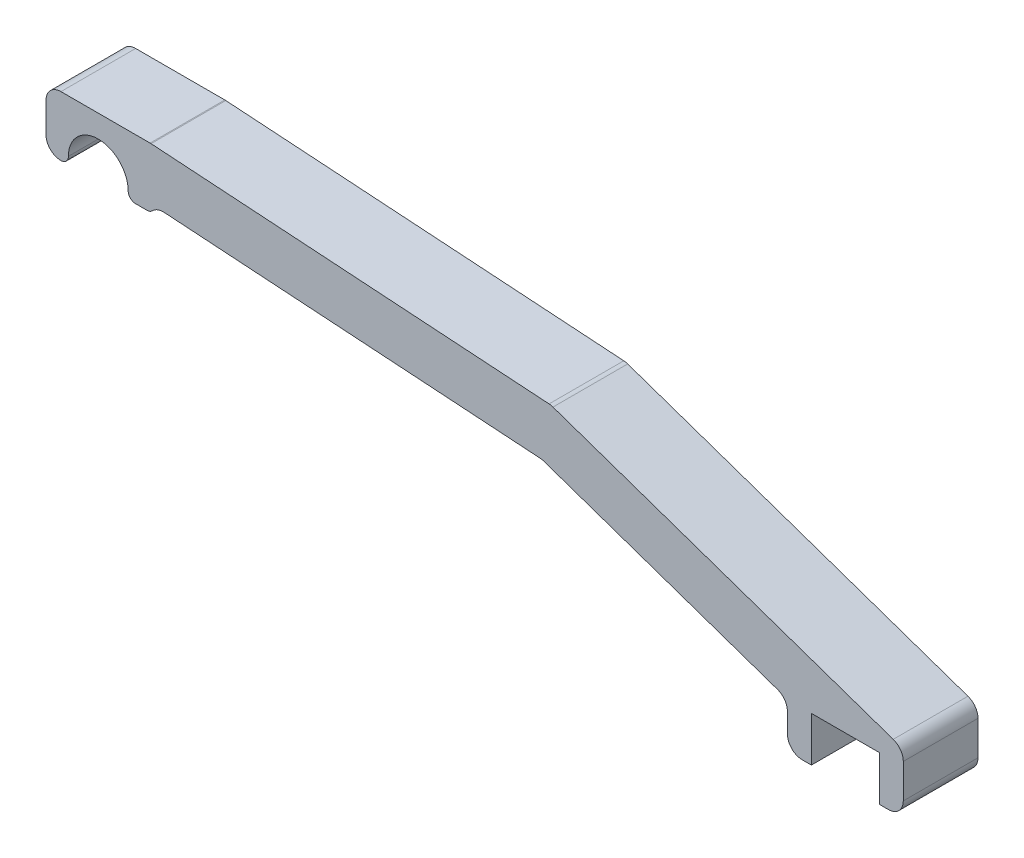
ISO-10303-21;
HEADER;
FILE_DESCRIPTION(('STEP AP214'),'2;1');
FILE_NAME('part.step','',(''),(''),'','','');
FILE_SCHEMA(('AUTOMOTIVE_DESIGN { 1 0 10303 214 1 1 1 1 }'));
ENDSEC;
DATA;
#1=APPLICATION_CONTEXT('core data for automotive mechanical design processes');
#2=APPLICATION_PROTOCOL_DEFINITION('international standard','automotive_design',2000,#1);
#3=PRODUCT_CONTEXT('',#1,'mechanical');
#4=PRODUCT('Part','Part','',(#3));
#5=PRODUCT_RELATED_PRODUCT_CATEGORY('part','',(#4));
#6=PRODUCT_DEFINITION_FORMATION('','',#4);
#7=PRODUCT_DEFINITION_CONTEXT('part definition',#1,'design');
#8=PRODUCT_DEFINITION('design','',#6,#7);
#9=PRODUCT_DEFINITION_SHAPE('','',#8);
#10=(LENGTH_UNIT() NAMED_UNIT(*) SI_UNIT(.MILLI.,.METRE.));
#11=(NAMED_UNIT(*) PLANE_ANGLE_UNIT() SI_UNIT($,.RADIAN.));
#12=(NAMED_UNIT(*) SI_UNIT($,.STERADIAN.) SOLID_ANGLE_UNIT());
#13=UNCERTAINTY_MEASURE_WITH_UNIT(LENGTH_MEASURE(1.E-05),#10,'distance_accuracy_value','');
#14=(GEOMETRIC_REPRESENTATION_CONTEXT(3) GLOBAL_UNCERTAINTY_ASSIGNED_CONTEXT((#13)) GLOBAL_UNIT_ASSIGNED_CONTEXT((#10,
#11,#12)) REPRESENTATION_CONTEXT('',''));
#15=CARTESIAN_POINT('',(0.,0.,0.));
#16=DIRECTION('',(0.,0.,1.));
#17=DIRECTION('',(1.,0.,0.));
#18=AXIS2_PLACEMENT_3D('',#15,#16,#17);
#19=CARTESIAN_POINT('',(5.27458819729548,15.259473004094,10.));
#20=DIRECTION('',(0.326693657196883,0.945130284324508,0.));
#21=DIRECTION('',(-0.945130284324508,0.326693657196883,0.));
#22=AXIS2_PLACEMENT_3D('',#19,#20,#21);
#23=PLANE('',#22);
#24=DIRECTION('',(0.945130284324508,-0.326693657196883,0.));
#25=VECTOR('',#24,1.);
#26=CARTESIAN_POINT('',(5.27458819729548,15.259473004094,0.));
#27=LINE('',#26,#25);
#28=CARTESIAN_POINT('',(59.6457245259634,-3.53444955638977,0.));
#29=VERTEX_POINT('',#28);
#30=CARTESIAN_POINT('',(90.8986217279982,-14.3373234609417,0.));
#31=VERTEX_POINT('',#30);
#32=EDGE_CURVE('E299',#29,#31,#27,.T.);
#33=ORIENTED_EDGE('',*,*,#32,.T.);
#34=DIRECTION('',(0.,0.,-1.));
#35=VECTOR('',#34,1.);
#36=CARTESIAN_POINT('',(90.8986217279982,-14.3373234609417,10.));
#37=LINE('',#36,#35);
#38=CARTESIAN_POINT('',(90.8986217279982,-14.3373234609417,10.));
#39=VERTEX_POINT('',#38);
#40=EDGE_CURVE('E428',#31,#39,#37,.F.);
#41=ORIENTED_EDGE('',*,*,#40,.T.);
#42=DIRECTION('',(0.945130284324508,-0.326693657196883,0.));
#43=VECTOR('',#42,1.);
#44=CARTESIAN_POINT('',(5.27458819729548,15.259473004094,10.));
#45=LINE('',#44,#43);
#46=CARTESIAN_POINT('',(59.6457245259634,-3.53444955638977,10.));
#47=VERTEX_POINT('',#46);
#48=EDGE_CURVE('E354',#47,#39,#45,.T.);
#49=ORIENTED_EDGE('',*,*,#48,.F.);
#50=DIRECTION('',(0.,0.,-1.));
#51=VECTOR('',#50,1.);
#52=CARTESIAN_POINT('',(59.6457245259634,-3.53444955638977,10.));
#53=LINE('',#52,#51);
#54=EDGE_CURVE('E424',#47,#29,#53,.T.);
#55=ORIENTED_EDGE('',*,*,#54,.T.);
#56=EDGE_LOOP('',(#33,#41,#49,#55));
#57=FACE_BOUND('',#56,.T.);
#58=ADVANCED_FACE('F41',(#57),#23,.F.);
#59=CARTESIAN_POINT('',(92.2452344136045,0.,10.));
#60=DIRECTION('',(1.,0.,0.));
#61=DIRECTION('',(0.,0.,-1.));
#62=AXIS2_PLACEMENT_3D('',#59,#60,#61);
#63=PLANE('',#62);
#64=DIRECTION('',(0.,-1.,0.));
#65=VECTOR('',#64,1.);
#66=CARTESIAN_POINT('',(92.2452344136045,0.,0.));
#67=LINE('',#66,#65);
#68=CARTESIAN_POINT('',(92.2452344136045,-16.2275840295907,0.));
#69=VERTEX_POINT('',#68);
#70=CARTESIAN_POINT('',(92.2452344136045,-18.85,0.));
#71=VERTEX_POINT('',#70);
#72=EDGE_CURVE('E303',#69,#71,#67,.T.);
#73=ORIENTED_EDGE('',*,*,#72,.T.);
#74=DIRECTION('',(0.,0.,-1.));
#75=VECTOR('',#74,1.);
#76=CARTESIAN_POINT('',(92.2452344136045,-18.85,10.));
#77=LINE('',#76,#75);
#78=CARTESIAN_POINT('',(92.2452344136045,-18.85,10.));
#79=VERTEX_POINT('',#78);
#80=EDGE_CURVE('E421',#71,#79,#77,.F.);
#81=ORIENTED_EDGE('',*,*,#80,.T.);
#82=DIRECTION('',(0.,-1.,0.));
#83=VECTOR('',#82,1.);
#84=CARTESIAN_POINT('',(92.2452344136045,0.,10.));
#85=LINE('',#84,#83);
#86=CARTESIAN_POINT('',(92.2452344136045,-16.2275840295907,10.));
#87=VERTEX_POINT('',#86);
#88=EDGE_CURVE('E238',#87,#79,#85,.T.);
#89=ORIENTED_EDGE('',*,*,#88,.F.);
#90=DIRECTION('',(0.,0.,-1.));
#91=VECTOR('',#90,1.);
#92=CARTESIAN_POINT('',(92.2452344136045,-16.2275840295907,0.));
#93=LINE('',#92,#91);
#94=EDGE_CURVE('E417',#87,#69,#93,.T.);
#95=ORIENTED_EDGE('',*,*,#94,.T.);
#96=EDGE_LOOP('',(#73,#81,#89,#95));
#97=FACE_BOUND('',#96,.T.);
#98=ADVANCED_FACE('F634',(#97),#63,.F.);
#99=CARTESIAN_POINT('',(0.,-20.85,10.));
#100=DIRECTION('',(0.,1.,0.));
#101=DIRECTION('',(0.,0.,1.));
#102=AXIS2_PLACEMENT_3D('',#99,#100,#101);
#103=PLANE('',#102);
#104=DIRECTION('',(1.,0.,0.));
#105=VECTOR('',#104,1.);
#106=CARTESIAN_POINT('',(0.,-20.85,10.));
#107=LINE('',#106,#105);
#108=CARTESIAN_POINT('',(94.2452344136045,-20.85,10.));
#109=VERTEX_POINT('',#108);
#110=CARTESIAN_POINT('',(95.45,-20.85,10.));
#111=VERTEX_POINT('',#110);
#112=EDGE_CURVE('E224',#109,#111,#107,.T.);
#113=ORIENTED_EDGE('',*,*,#112,.F.);
#114=DIRECTION('',(0.,0.,-1.));
#115=VECTOR('',#114,1.);
#116=CARTESIAN_POINT('',(94.2452344136045,-20.85,10.));
#117=LINE('',#116,#115);
#118=CARTESIAN_POINT('',(94.2452344136045,-20.85,0.));
#119=VERTEX_POINT('',#118);
#120=EDGE_CURVE('E414',#109,#119,#117,.T.);
#121=ORIENTED_EDGE('',*,*,#120,.T.);
#122=DIRECTION('',(1.,0.,0.));
#123=VECTOR('',#122,1.);
#124=CARTESIAN_POINT('',(0.,-20.85,0.));
#125=LINE('',#124,#123);
#126=CARTESIAN_POINT('',(95.45,-20.85,0.));
#127=VERTEX_POINT('',#126);
#128=EDGE_CURVE('E244',#119,#127,#125,.T.);
#129=ORIENTED_EDGE('',*,*,#128,.T.);
#130=DIRECTION('',(0.,0.,-1.));
#131=VECTOR('',#130,1.);
#132=CARTESIAN_POINT('',(95.45,-20.85,10.));
#133=LINE('',#132,#131);
#134=EDGE_CURVE('E241',#111,#127,#133,.T.);
#135=ORIENTED_EDGE('',*,*,#134,.F.);
#136=EDGE_LOOP('',(#113,#121,#129,#135));
#137=FACE_BOUND('',#136,.T.);
#138=ADVANCED_FACE('F242',(#137),#103,.F.);
#139=CARTESIAN_POINT('',(95.45,0.,10.));
#140=DIRECTION('',(-1.,0.,0.));
#141=DIRECTION('',(0.,0.,1.));
#142=AXIS2_PLACEMENT_3D('',#139,#140,#141);
#143=PLANE('',#142);
#144=DIRECTION('',(0.,1.,0.));
#145=VECTOR('',#144,1.);
#146=CARTESIAN_POINT('',(95.45,0.,0.));
#147=LINE('',#146,#145);
#148=CARTESIAN_POINT('',(95.45,-14.85,0.));
#149=VERTEX_POINT('',#148);
#150=EDGE_CURVE('E309',#127,#149,#147,.T.);
#151=ORIENTED_EDGE('',*,*,#150,.T.);
#152=DIRECTION('',(0.,0.,-1.));
#153=VECTOR('',#152,1.);
#154=CARTESIAN_POINT('',(95.45,-14.85,10.));
#155=LINE('',#154,#153);
#156=CARTESIAN_POINT('',(95.45,-14.85,10.));
#157=VERTEX_POINT('',#156);
#158=EDGE_CURVE('E249',#157,#149,#155,.T.);
#159=ORIENTED_EDGE('',*,*,#158,.F.);
#160=DIRECTION('',(0.,1.,0.));
#161=VECTOR('',#160,1.);
#162=CARTESIAN_POINT('',(95.45,0.,10.));
#163=LINE('',#162,#161);
#164=EDGE_CURVE('E229',#111,#157,#163,.T.);
#165=ORIENTED_EDGE('',*,*,#164,.F.);
#166=ORIENTED_EDGE('',*,*,#134,.T.);
#167=EDGE_LOOP('',(#151,#159,#165,#166));
#168=FACE_BOUND('',#167,.T.);
#169=ADVANCED_FACE('F251',(#168),#143,.F.);
#170=CARTESIAN_POINT('',(0.,-14.85,10.));
#171=DIRECTION('',(0.,1.,0.));
#172=DIRECTION('',(-1.,0.,0.));
#173=AXIS2_PLACEMENT_3D('',#170,#171,#172);
#174=PLANE('',#173);
#175=DIRECTION('',(1.,0.,0.));
#176=VECTOR('',#175,1.);
#177=CARTESIAN_POINT('',(0.,-14.85,0.));
#178=LINE('',#177,#176);
#179=CARTESIAN_POINT('',(104.55,-14.85,0.));
#180=VERTEX_POINT('',#179);
#181=EDGE_CURVE('E312',#149,#180,#178,.T.);
#182=ORIENTED_EDGE('',*,*,#181,.T.);
#183=DIRECTION('',(0.,0.,-1.));
#184=VECTOR('',#183,1.);
#185=CARTESIAN_POINT('',(104.55,-14.85,10.));
#186=LINE('',#185,#184);
#187=CARTESIAN_POINT('',(104.55,-14.85,10.));
#188=VERTEX_POINT('',#187);
#189=EDGE_CURVE('E358',#188,#180,#186,.T.);
#190=ORIENTED_EDGE('',*,*,#189,.F.);
#191=DIRECTION('',(1.,0.,0.));
#192=VECTOR('',#191,1.);
#193=CARTESIAN_POINT('',(0.,-14.85,10.));
#194=LINE('',#193,#192);
#195=EDGE_CURVE('E255',#157,#188,#194,.T.);
#196=ORIENTED_EDGE('',*,*,#195,.F.);
#197=ORIENTED_EDGE('',*,*,#158,.T.);
#198=EDGE_LOOP('',(#182,#190,#196,#197));
#199=FACE_BOUND('',#198,.T.);
#200=ADVANCED_FACE('F569',(#199),#174,.F.);
#201=CARTESIAN_POINT('',(104.55,0.,10.));
#202=DIRECTION('',(1.,0.,0.));
#203=DIRECTION('',(0.,0.,-1.));
#204=AXIS2_PLACEMENT_3D('',#201,#202,#203);
#205=PLANE('',#204);
#206=DIRECTION('',(0.,-1.,0.));
#207=VECTOR('',#206,1.);
#208=CARTESIAN_POINT('',(104.55,0.,0.));
#209=LINE('',#208,#207);
#210=CARTESIAN_POINT('',(104.55,-20.85,0.));
#211=VERTEX_POINT('',#210);
#212=EDGE_CURVE('E315',#180,#211,#209,.T.);
#213=ORIENTED_EDGE('',*,*,#212,.T.);
#214=DIRECTION('',(0.,0.,-1.));
#215=VECTOR('',#214,1.);
#216=CARTESIAN_POINT('',(104.55,-20.85,10.));
#217=LINE('',#216,#215);
#218=CARTESIAN_POINT('',(104.55,-20.85,10.));
#219=VERTEX_POINT('',#218);
#220=EDGE_CURVE('E298',#219,#211,#217,.T.);
#221=ORIENTED_EDGE('',*,*,#220,.F.);
#222=DIRECTION('',(0.,-1.,0.));
#223=VECTOR('',#222,1.);
#224=CARTESIAN_POINT('',(104.55,0.,10.));
#225=LINE('',#224,#223);
#226=EDGE_CURVE('E258',#188,#219,#225,.T.);
#227=ORIENTED_EDGE('',*,*,#226,.F.);
#228=ORIENTED_EDGE('',*,*,#189,.T.);
#229=EDGE_LOOP('',(#213,#221,#227,#228));
#230=FACE_BOUND('',#229,.T.);
#231=ADVANCED_FACE('F576',(#230),#205,.F.);
#232=CARTESIAN_POINT('',(0.,-20.8500000000001,10.));
#233=DIRECTION('',(0.,1.,0.));
#234=DIRECTION('',(-1.,0.,0.));
#235=AXIS2_PLACEMENT_3D('',#232,#233,#234);
#236=PLANE('',#235);
#237=DIRECTION('',(1.,0.,0.));
#238=VECTOR('',#237,1.);
#239=CARTESIAN_POINT('',(0.,-20.8500000000001,0.));
#240=LINE('',#239,#238);
#241=CARTESIAN_POINT('',(105.754765586396,-20.85,0.));
#242=VERTEX_POINT('',#241);
#243=EDGE_CURVE('E318',#211,#242,#240,.T.);
#244=ORIENTED_EDGE('',*,*,#243,.T.);
#245=DIRECTION('',(0.,0.,-1.));
#246=VECTOR('',#245,1.);
#247=CARTESIAN_POINT('',(105.754765586396,-20.85,10.));
#248=LINE('',#247,#246);
#249=CARTESIAN_POINT('',(105.754765586396,-20.85,10.));
#250=VERTEX_POINT('',#249);
#251=EDGE_CURVE('E391',#242,#250,#248,.F.);
#252=ORIENTED_EDGE('',*,*,#251,.T.);
#253=DIRECTION('',(1.,0.,0.));
#254=VECTOR('',#253,1.);
#255=CARTESIAN_POINT('',(0.,-20.8500000000001,10.));
#256=LINE('',#255,#254);
#257=EDGE_CURVE('E264',#219,#250,#256,.T.);
#258=ORIENTED_EDGE('',*,*,#257,.F.);
#259=ORIENTED_EDGE('',*,*,#220,.T.);
#260=EDGE_LOOP('',(#244,#252,#258,#259));
#261=FACE_BOUND('',#260,.T.);
#262=ADVANCED_FACE('F579',(#261),#236,.F.);
#263=CARTESIAN_POINT('',(107.754765586396,0.,10.));
#264=DIRECTION('',(1.,0.,0.));
#265=DIRECTION('',(0.,0.,-1.));
#266=AXIS2_PLACEMENT_3D('',#263,#264,#265);
#267=PLANE('',#266);
#268=DIRECTION('',(0.,-1.,0.));
#269=VECTOR('',#268,1.);
#270=CARTESIAN_POINT('',(107.754765586396,0.,10.));
#271=LINE('',#270,#269);
#272=CARTESIAN_POINT('',(107.754765586396,-14.2747905372841,10.));
#273=VERTEX_POINT('',#272);
#274=CARTESIAN_POINT('',(107.754765586396,-18.85,10.));
#275=VERTEX_POINT('',#274);
#276=EDGE_CURVE('E268',#273,#275,#271,.T.);
#277=ORIENTED_EDGE('',*,*,#276,.T.);
#278=DIRECTION('',(0.,0.,-1.));
#279=VECTOR('',#278,1.);
#280=CARTESIAN_POINT('',(107.754765586396,-18.85,0.));
#281=LINE('',#280,#279);
#282=CARTESIAN_POINT('',(107.754765586396,-18.85,0.));
#283=VERTEX_POINT('',#282);
#284=EDGE_CURVE('E366',#275,#283,#281,.T.);
#285=ORIENTED_EDGE('',*,*,#284,.T.);
#286=DIRECTION('',(0.,-1.,0.));
#287=VECTOR('',#286,1.);
#288=CARTESIAN_POINT('',(107.754765586396,0.,0.));
#289=LINE('',#288,#287);
#290=CARTESIAN_POINT('',(107.754765586396,-14.2747905372841,0.));
#291=VERTEX_POINT('',#290);
#292=EDGE_CURVE('E322',#291,#283,#289,.T.);
#293=ORIENTED_EDGE('',*,*,#292,.F.);
#294=DIRECTION('',(0.,0.,-1.));
#295=VECTOR('',#294,1.);
#296=CARTESIAN_POINT('',(107.754765586396,-14.2747905372841,10.));
#297=LINE('',#296,#295);
#298=EDGE_CURVE('E248',#291,#273,#297,.F.);
#299=ORIENTED_EDGE('',*,*,#298,.T.);
#300=EDGE_LOOP('',(#277,#285,#293,#299));
#301=FACE_BOUND('',#300,.T.);
#302=ADVANCED_FACE('F587',(#301),#267,.T.);
#303=CARTESIAN_POINT('',(7.53286128102545,21.7926952895264,10.));
#304=DIRECTION('',(0.326693657196883,0.945130284324508,0.));
#305=DIRECTION('',(-0.945130284324508,0.326693657196883,0.));
#306=AXIS2_PLACEMENT_3D('',#303,#304,#305);
#307=PLANE('',#306);
#308=DIRECTION('',(0.945130284324508,-0.326693657196883,0.));
#309=VECTOR('',#308,1.);
#310=CARTESIAN_POINT('',(7.53286128102545,21.7926952895264,10.));
#311=LINE('',#310,#309);
#312=CARTESIAN_POINT('',(60.8612617696319,3.35920471469569,10.));
#313=VERTEX_POINT('',#312);
#314=CARTESIAN_POINT('',(106.408152900789,-12.3845299686351,10.));
#315=VERTEX_POINT('',#314);
#316=EDGE_CURVE('E272',#313,#315,#311,.T.);
#317=ORIENTED_EDGE('',*,*,#316,.T.);
#318=DIRECTION('',(0.,0.,-1.));
#319=VECTOR('',#318,1.);
#320=CARTESIAN_POINT('',(106.408152900789,-12.3845299686351,10.));
#321=LINE('',#320,#319);
#322=CARTESIAN_POINT('',(106.408152900789,-12.3845299686351,0.));
#323=VERTEX_POINT('',#322);
#324=EDGE_CURVE('E452',#315,#323,#321,.T.);
#325=ORIENTED_EDGE('',*,*,#324,.T.);
#326=DIRECTION('',(0.945130284324508,-0.326693657196883,0.));
#327=VECTOR('',#326,1.);
#328=CARTESIAN_POINT('',(7.53286128102545,21.7926952895264,0.));
#329=LINE('',#328,#327);
#330=CARTESIAN_POINT('',(60.8612617696319,3.35920471469569,0.));
#331=VERTEX_POINT('',#330);
#332=EDGE_CURVE('E326',#331,#323,#329,.T.);
#333=ORIENTED_EDGE('',*,*,#332,.F.);
#334=DIRECTION('',(0.,0.,-1.));
#335=VECTOR('',#334,1.);
#336=CARTESIAN_POINT('',(60.8612617696319,3.35920471469569,10.));
#337=LINE('',#336,#335);
#338=EDGE_CURVE('E449',#331,#313,#337,.F.);
#339=ORIENTED_EDGE('',*,*,#338,.T.);
#340=EDGE_LOOP('',(#317,#325,#333,#339));
#341=FACE_BOUND('',#340,.T.);
#342=ADVANCED_FACE('F596',(#341),#307,.T.);
#343=CARTESIAN_POINT('',(0.49255478436386,7.4313195335596,10.));
#344=DIRECTION('',(-0.0661358184799915,-0.997810630086682,0.));
#345=DIRECTION('',(0.997810630086682,-0.0661358184799915,0.));
#346=AXIS2_PLACEMENT_3D('',#343,#344,#345);
#347=PLANE('',#346);
#348=DIRECTION('',(-0.997810630086682,0.0661358184799915,0.));
#349=VECTOR('',#348,1.);
#350=CARTESIAN_POINT('',(0.49255478436386,7.4313195335596,0.));
#351=LINE('',#350,#349);
#352=CARTESIAN_POINT('',(60.3401460921981,3.46456540622003,0.));
#353=VERTEX_POINT('',#352);
#354=CARTESIAN_POINT('',(7.06606334125469,6.99562126017336,0.));
#355=VERTEX_POINT('',#354);
#356=EDGE_CURVE('E330',#353,#355,#351,.T.);
#357=ORIENTED_EDGE('',*,*,#356,.T.);
#358=DIRECTION('',(0.,0.,-1.));
#359=VECTOR('',#358,1.);
#360=CARTESIAN_POINT('',(7.06606334125469,6.99562126017336,10.));
#361=LINE('',#360,#359);
#362=CARTESIAN_POINT('',(7.06606334125469,6.99562126017336,10.));
#363=VERTEX_POINT('',#362);
#364=EDGE_CURVE('E467',#355,#363,#361,.F.);
#365=ORIENTED_EDGE('',*,*,#364,.T.);
#366=DIRECTION('',(-0.997810630086682,0.0661358184799915,0.));
#367=VECTOR('',#366,1.);
#368=CARTESIAN_POINT('',(0.49255478436386,7.4313195335596,10.));
#369=LINE('',#368,#367);
#370=CARTESIAN_POINT('',(60.3401460921981,3.46456540622003,10.));
#371=VERTEX_POINT('',#370);
#372=EDGE_CURVE('E276',#371,#363,#369,.T.);
#373=ORIENTED_EDGE('',*,*,#372,.F.);
#374=DIRECTION('',(0.,0.,-1.));
#375=VECTOR('',#374,1.);
#376=CARTESIAN_POINT('',(60.3401460921981,3.46456540622003,0.));
#377=LINE('',#376,#375);
#378=EDGE_CURVE('E463',#371,#353,#377,.T.);
#379=ORIENTED_EDGE('',*,*,#378,.T.);
#380=EDGE_LOOP('',(#357,#365,#373,#379));
#381=FACE_BOUND('',#380,.T.);
#382=ADVANCED_FACE('F605',(#381),#347,.F.);
#383=CARTESIAN_POINT('',(0.,7.,10.));
#384=DIRECTION('',(0.,1.,0.));
#385=DIRECTION('',(0.,0.,1.));
#386=AXIS2_PLACEMENT_3D('',#383,#384,#385);
#387=PLANE('',#386);
#388=DIRECTION('',(1.,0.,0.));
#389=VECTOR('',#388,1.);
#390=CARTESIAN_POINT('',(0.,7.,10.));
#391=LINE('',#390,#389);
#392=CARTESIAN_POINT('',(-5.,7.,10.));
#393=VERTEX_POINT('',#392);
#394=CARTESIAN_POINT('',(6.93379170429471,7.,10.));
#395=VERTEX_POINT('',#394);
#396=EDGE_CURVE('E280',#393,#395,#391,.T.);
#397=ORIENTED_EDGE('',*,*,#396,.T.);
#398=DIRECTION('',(0.,0.,-1.));
#399=VECTOR('',#398,1.);
#400=CARTESIAN_POINT('',(6.93379170429471,7.,0.));
#401=LINE('',#400,#399);
#402=CARTESIAN_POINT('',(6.93379170429471,7.,0.));
#403=VERTEX_POINT('',#402);
#404=EDGE_CURVE('E459',#395,#403,#401,.T.);
#405=ORIENTED_EDGE('',*,*,#404,.T.);
#406=DIRECTION('',(1.,0.,0.));
#407=VECTOR('',#406,1.);
#408=CARTESIAN_POINT('',(0.,7.,0.));
#409=LINE('',#408,#407);
#410=CARTESIAN_POINT('',(-5.,7.,0.));
#411=VERTEX_POINT('',#410);
#412=EDGE_CURVE('E334',#411,#403,#409,.T.);
#413=ORIENTED_EDGE('',*,*,#412,.F.);
#414=DIRECTION('',(0.,0.,-1.));
#415=VECTOR('',#414,1.);
#416=CARTESIAN_POINT('',(-5.,7.,10.));
#417=LINE('',#416,#415);
#418=EDGE_CURVE('E456',#411,#393,#417,.F.);
#419=ORIENTED_EDGE('',*,*,#418,.T.);
#420=EDGE_LOOP('',(#397,#405,#413,#419));
#421=FACE_BOUND('',#420,.T.);
#422=ADVANCED_FACE('F614',(#421),#387,.T.);
#423=CARTESIAN_POINT('',(-7.,0.,10.));
#424=DIRECTION('',(1.,0.,0.));
#425=DIRECTION('',(0.,1.,0.));
#426=AXIS2_PLACEMENT_3D('',#423,#424,#425);
#427=PLANE('',#426);
#428=DIRECTION('',(0.,-1.,0.));
#429=VECTOR('',#428,1.);
#430=CARTESIAN_POINT('',(-7.,0.,0.));
#431=LINE('',#430,#429);
#432=CARTESIAN_POINT('',(-7.,5.,0.));
#433=VERTEX_POINT('',#432);
#434=CARTESIAN_POINT('',(-7.,1.,0.));
#435=VERTEX_POINT('',#434);
#436=EDGE_CURVE('E338',#433,#435,#431,.T.);
#437=ORIENTED_EDGE('',*,*,#436,.T.);
#438=DIRECTION('',(0.,0.,-1.));
#439=VECTOR('',#438,1.);
#440=CARTESIAN_POINT('',(-7.,1.,10.));
#441=LINE('',#440,#439);
#442=CARTESIAN_POINT('',(-7.,1.,10.));
#443=VERTEX_POINT('',#442);
#444=EDGE_CURVE('E446',#435,#443,#441,.F.);
#445=ORIENTED_EDGE('',*,*,#444,.T.);
#446=DIRECTION('',(0.,-1.,0.));
#447=VECTOR('',#446,1.);
#448=CARTESIAN_POINT('',(-7.,0.,10.));
#449=LINE('',#448,#447);
#450=CARTESIAN_POINT('',(-7.,5.,10.));
#451=VERTEX_POINT('',#450);
#452=EDGE_CURVE('E284',#451,#443,#449,.T.);
#453=ORIENTED_EDGE('',*,*,#452,.F.);
#454=DIRECTION('',(0.,0.,-1.));
#455=VECTOR('',#454,1.);
#456=CARTESIAN_POINT('',(-7.,5.,0.));
#457=LINE('',#456,#455);
#458=EDGE_CURVE('E442',#451,#433,#457,.T.);
#459=ORIENTED_EDGE('',*,*,#458,.T.);
#460=EDGE_LOOP('',(#437,#445,#453,#459));
#461=FACE_BOUND('',#460,.T.);
#462=ADVANCED_FACE('F623',(#461),#427,.F.);
#463=CARTESIAN_POINT('',(0.,0.,10.));
#464=DIRECTION('',(0.,0.,-1.));
#465=DIRECTION('',(-1.,0.,0.));
#466=AXIS2_PLACEMENT_3D('',#463,#464,#465);
#467=CYLINDRICAL_SURFACE('',#466,4.);
#468=CARTESIAN_POINT('',(0.,0.,0.));
#469=DIRECTION('',(0.,0.,1.));
#470=DIRECTION('',(1.,0.,0.));
#471=AXIS2_PLACEMENT_3D('',#468,#469,#470);
#472=CIRCLE('',#471,4.);
#473=CARTESIAN_POINT('',(4.,0.,0.));
#474=VERTEX_POINT('',#473);
#475=CARTESIAN_POINT('',(-4.,0.,0.));
#476=VERTEX_POINT('',#475);
#477=EDGE_CURVE('E342',#474,#476,#472,.T.);
#478=ORIENTED_EDGE('',*,*,#477,.F.);
#479=DIRECTION('',(0.,0.,-1.));
#480=VECTOR('',#479,1.);
#481=CARTESIAN_POINT('',(4.,0.,10.));
#482=LINE('',#481,#480);
#483=CARTESIAN_POINT('',(4.,0.,10.));
#484=VERTEX_POINT('',#483);
#485=EDGE_CURVE('E11',#474,#484,#482,.F.);
#486=ORIENTED_EDGE('',*,*,#485,.T.);
#487=CARTESIAN_POINT('',(0.,0.,10.));
#488=DIRECTION('',(0.,0.,1.));
#489=DIRECTION('',(1.,0.,0.));
#490=AXIS2_PLACEMENT_3D('',#487,#488,#489);
#491=CIRCLE('',#490,4.);
#492=CARTESIAN_POINT('',(-4.,0.,10.));
#493=VERTEX_POINT('',#492);
#494=EDGE_CURVE('E288',#484,#493,#491,.T.);
#495=ORIENTED_EDGE('',*,*,#494,.T.);
#496=DIRECTION('',(0.,0.,-1.));
#497=VECTOR('',#496,1.);
#498=CARTESIAN_POINT('',(-4.,0.,10.));
#499=LINE('',#498,#497);
#500=EDGE_CURVE('E50',#493,#476,#499,.T.);
#501=ORIENTED_EDGE('',*,*,#500,.T.);
#502=EDGE_LOOP('',(#478,#486,#495,#501));
#503=FACE_BOUND('',#502,.T.);
#504=ADVANCED_FACE('F519',(#503),#467,.F.);
#505=CARTESIAN_POINT('',(0.,-1.,10.));
#506=DIRECTION('',(0.,1.,0.));
#507=DIRECTION('',(0.,0.,1.));
#508=AXIS2_PLACEMENT_3D('',#505,#506,#507);
#509=PLANE('',#508);
#510=DIRECTION('',(1.,0.,0.));
#511=VECTOR('',#510,1.);
#512=CARTESIAN_POINT('',(0.,-1.,0.));
#513=LINE('',#512,#511);
#514=CARTESIAN_POINT('',(5.,-1.,0.));
#515=VERTEX_POINT('',#514);
#516=CARTESIAN_POINT('',(6.52461149118166,-1.,0.));
#517=VERTEX_POINT('',#516);
#518=EDGE_CURVE('E346',#515,#517,#513,.T.);
#519=ORIENTED_EDGE('',*,*,#518,.T.);
#520=DIRECTION('',(0.,0.,1.));
#521=VECTOR('',#520,1.);
#522=CARTESIAN_POINT('',(6.52461149118166,-1.,10.));
#523=LINE('',#522,#521);
#524=CARTESIAN_POINT('',(6.52461149118166,-1.,10.));
#525=VERTEX_POINT('',#524);
#526=EDGE_CURVE('E506',#517,#525,#523,.T.);
#527=ORIENTED_EDGE('',*,*,#526,.T.);
#528=DIRECTION('',(1.,0.,0.));
#529=VECTOR('',#528,1.);
#530=CARTESIAN_POINT('',(0.,-1.,10.));
#531=LINE('',#530,#529);
#532=CARTESIAN_POINT('',(5.,-1.,10.));
#533=VERTEX_POINT('',#532);
#534=EDGE_CURVE('E291',#533,#525,#531,.T.);
#535=ORIENTED_EDGE('',*,*,#534,.F.);
#536=DIRECTION('',(0.,0.,1.));
#537=VECTOR('',#536,1.);
#538=CARTESIAN_POINT('',(5.,-1.,0.));
#539=LINE('',#538,#537);
#540=EDGE_CURVE('E502',#533,#515,#539,.F.);
#541=ORIENTED_EDGE('',*,*,#540,.T.);
#542=EDGE_LOOP('',(#519,#527,#535,#541));
#543=FACE_BOUND('',#542,.T.);
#544=ADVANCED_FACE('F531',(#543),#509,.F.);
#545=CARTESIAN_POINT('',(0.0323187939583458,0.487603191498642,10.));
#546=DIRECTION('',(-0.0661358184799915,-0.997810630086682,0.));
#547=DIRECTION('',(0.997810630086682,-0.0661358184799915,0.));
#548=AXIS2_PLACEMENT_3D('',#545,#546,#547);
#549=PLANE('',#548);
#550=DIRECTION('',(-0.997810630086682,0.0661358184799915,0.));
#551=VECTOR('',#550,1.);
#552=CARTESIAN_POINT('',(0.0323187939583458,0.487603191498642,0.));
#553=LINE('',#552,#551);
#554=CARTESIAN_POINT('',(59.1246088485296,-3.42908886486542,0.));
#555=VERTEX_POINT('',#554);
#556=CARTESIAN_POINT('',(8.80929687502934,-0.0941430954918547,0.));
#557=VERTEX_POINT('',#556);
#558=EDGE_CURVE('E350',#555,#557,#553,.T.);
#559=ORIENTED_EDGE('',*,*,#558,.F.);
#560=DIRECTION('',(0.,0.,-1.));
#561=VECTOR('',#560,1.);
#562=CARTESIAN_POINT('',(59.1246088485296,-3.42908886486542,10.));
#563=LINE('',#562,#561);
#564=CARTESIAN_POINT('',(59.1246088485296,-3.42908886486542,10.));
#565=VERTEX_POINT('',#564);
#566=EDGE_CURVE('E435',#555,#565,#563,.F.);
#567=ORIENTED_EDGE('',*,*,#566,.T.);
#568=DIRECTION('',(-0.997810630086682,0.0661358184799915,0.));
#569=VECTOR('',#568,1.);
#570=CARTESIAN_POINT('',(0.0323187939583458,0.487603191498642,10.));
#571=LINE('',#570,#569);
#572=CARTESIAN_POINT('',(8.80929687502934,-0.0941430954918547,10.));
#573=VERTEX_POINT('',#572);
#574=EDGE_CURVE('E294',#565,#573,#571,.T.);
#575=ORIENTED_EDGE('',*,*,#574,.T.);
#576=DIRECTION('',(0.,0.,-1.));
#577=VECTOR('',#576,1.);
#578=CARTESIAN_POINT('',(8.80929687502934,-0.0941430954918545,0.));
#579=LINE('',#578,#577);
#580=EDGE_CURVE('E431',#573,#557,#579,.T.);
#581=ORIENTED_EDGE('',*,*,#580,.T.);
#582=EDGE_LOOP('',(#559,#567,#575,#581));
#583=FACE_BOUND('',#582,.T.);
#584=ADVANCED_FACE('F545',(#583),#549,.T.);
#585=CARTESIAN_POINT('',(0.,0.,10.));
#586=DIRECTION('',(0.,0.,1.));
#587=DIRECTION('',(1.,0.,0.));
#588=AXIS2_PLACEMENT_3D('',#585,#586,#587);
#589=PLANE('',#588);
#590=ORIENTED_EDGE('',*,*,#534,.T.);
#591=CARTESIAN_POINT('',(6.52461149118166,0.,10.));
#592=DIRECTION('',(0.,0.,1.));
#593=DIRECTION('',(1.,0.,0.));
#594=AXIS2_PLACEMENT_3D('',#591,#592,#593);
#595=CIRCLE('',#594,1.);
#596=CARTESIAN_POINT('',(7.24208274014422,-0.696588118555073,10.));
#597=VERTEX_POINT('',#596);
#598=EDGE_CURVE('E514',#525,#597,#595,.T.);
#599=ORIENTED_EDGE('',*,*,#598,.T.);
#600=CARTESIAN_POINT('',(8.67702523806935,-2.08976435566522,10.));
#601=DIRECTION('',(0.,0.,1.));
#602=DIRECTION('',(1.,0.,0.));
#603=AXIS2_PLACEMENT_3D('',#600,#601,#602);
#604=CIRCLE('',#603,2.);
#605=EDGE_CURVE('E486',#597,#573,#604,.F.);
#606=ORIENTED_EDGE('',*,*,#605,.T.);
#607=ORIENTED_EDGE('',*,*,#574,.F.);
#608=CARTESIAN_POINT('',(58.9923372115696,-5.42471012503878,10.));
#609=DIRECTION('',(0.,0.,1.));
#610=DIRECTION('',(1.,0.,0.));
#611=AXIS2_PLACEMENT_3D('',#608,#609,#610);
#612=CIRCLE('',#611,2.);
#613=EDGE_CURVE('E479',#565,#47,#612,.F.);
#614=ORIENTED_EDGE('',*,*,#613,.T.);
#615=ORIENTED_EDGE('',*,*,#48,.T.);
#616=CARTESIAN_POINT('',(90.2452344136045,-16.2275840295907,10.));
#617=DIRECTION('',(0.,0.,1.));
#618=DIRECTION('',(1.,0.,0.));
#619=AXIS2_PLACEMENT_3D('',#616,#617,#618);
#620=CIRCLE('',#619,2.);
#621=EDGE_CURVE('E473',#39,#87,#620,.F.);
#622=ORIENTED_EDGE('',*,*,#621,.T.);
#623=ORIENTED_EDGE('',*,*,#88,.T.);
#624=CARTESIAN_POINT('',(94.2452344136045,-18.85,10.));
#625=DIRECTION('',(0.,0.,1.));
#626=DIRECTION('',(1.,0.,0.));
#627=AXIS2_PLACEMENT_3D('',#624,#625,#626);
#628=CIRCLE('',#627,2.);
#629=EDGE_CURVE('E233',#79,#109,#628,.T.);
#630=ORIENTED_EDGE('',*,*,#629,.T.);
#631=ORIENTED_EDGE('',*,*,#112,.T.);
#632=ORIENTED_EDGE('',*,*,#164,.T.);
#633=ORIENTED_EDGE('',*,*,#195,.T.);
#634=ORIENTED_EDGE('',*,*,#226,.T.);
#635=ORIENTED_EDGE('',*,*,#257,.T.);
#636=CARTESIAN_POINT('',(105.754765586396,-18.85,10.));
#637=DIRECTION('',(0.,0.,1.));
#638=DIRECTION('',(1.,0.,0.));
#639=AXIS2_PLACEMENT_3D('',#636,#637,#638);
#640=CIRCLE('',#639,2.);
#641=EDGE_CURVE('E411',#250,#275,#640,.T.);
#642=ORIENTED_EDGE('',*,*,#641,.T.);
#643=ORIENTED_EDGE('',*,*,#276,.F.);
#644=CARTESIAN_POINT('',(105.754765586396,-14.2747905372841,10.));
#645=DIRECTION('',(0.,0.,1.));
#646=DIRECTION('',(1.,0.,0.));
#647=AXIS2_PLACEMENT_3D('',#644,#645,#646);
#648=CIRCLE('',#647,2.);
#649=EDGE_CURVE('E403',#273,#315,#648,.T.);
#650=ORIENTED_EDGE('',*,*,#649,.T.);
#651=ORIENTED_EDGE('',*,*,#316,.F.);
#652=CARTESIAN_POINT('',(60.2078744552382,1.46894414604667,10.));
#653=DIRECTION('',(0.,0.,1.));
#654=DIRECTION('',(1.,0.,0.));
#655=AXIS2_PLACEMENT_3D('',#652,#653,#654);
#656=CIRCLE('',#655,2.);
#657=EDGE_CURVE('E397',#313,#371,#656,.T.);
#658=ORIENTED_EDGE('',*,*,#657,.T.);
#659=ORIENTED_EDGE('',*,*,#372,.T.);
#660=CARTESIAN_POINT('',(6.93379170429471,5.,10.));
#661=DIRECTION('',(0.,0.,1.));
#662=DIRECTION('',(1.,0.,0.));
#663=AXIS2_PLACEMENT_3D('',#660,#661,#662);
#664=CIRCLE('',#663,2.);
#665=EDGE_CURVE('E400',#363,#395,#664,.T.);
#666=ORIENTED_EDGE('',*,*,#665,.T.);
#667=ORIENTED_EDGE('',*,*,#396,.F.);
#668=CARTESIAN_POINT('',(-5.,5.,10.));
#669=DIRECTION('',(0.,0.,1.));
#670=DIRECTION('',(1.,0.,0.));
#671=AXIS2_PLACEMENT_3D('',#668,#669,#670);
#672=CIRCLE('',#671,2.);
#673=EDGE_CURVE('E394',#393,#451,#672,.T.);
#674=ORIENTED_EDGE('',*,*,#673,.T.);
#675=ORIENTED_EDGE('',*,*,#452,.T.);
#676=CARTESIAN_POINT('',(-5.,1.,10.));
#677=DIRECTION('',(0.,0.,1.));
#678=DIRECTION('',(1.,0.,0.));
#679=AXIS2_PLACEMENT_3D('',#676,#677,#678);
#680=CIRCLE('',#679,2.);
#681=CARTESIAN_POINT('',(-5.,-1.,10.));
#682=VERTEX_POINT('',#681);
#683=EDGE_CURVE('E406',#443,#682,#680,.T.);
#684=ORIENTED_EDGE('',*,*,#683,.T.);
#685=CARTESIAN_POINT('',(-5.,0.,10.));
#686=DIRECTION('',(0.,0.,1.));
#687=DIRECTION('',(1.,0.,0.));
#688=AXIS2_PLACEMENT_3D('',#685,#686,#687);
#689=CIRCLE('',#688,1.);
#690=EDGE_CURVE('E57',#682,#493,#689,.T.);
#691=ORIENTED_EDGE('',*,*,#690,.T.);
#692=ORIENTED_EDGE('',*,*,#494,.F.);
#693=CARTESIAN_POINT('',(5.,0.,10.));
#694=DIRECTION('',(0.,0.,1.));
#695=DIRECTION('',(1.,0.,0.));
#696=AXIS2_PLACEMENT_3D('',#693,#694,#695);
#697=CIRCLE('',#696,1.);
#698=EDGE_CURVE('E511',#484,#533,#697,.T.);
#699=ORIENTED_EDGE('',*,*,#698,.T.);
#700=EDGE_LOOP('',(#590,#599,#606,#607,#614,#615,#622,#623,#630,#631,#632,#633,#634,#635,#642,
#643,#650,#651,#658,#659,#666,#667,#674,#675,#684,#691,#692,#699));
#701=FACE_BOUND('',#700,.T.);
#702=ADVANCED_FACE('F227',(#701),#589,.T.);
#703=CARTESIAN_POINT('',(0.,0.,0.));
#704=DIRECTION('',(0.,0.,1.));
#705=DIRECTION('',(1.,0.,0.));
#706=AXIS2_PLACEMENT_3D('',#703,#704,#705);
#707=PLANE('',#706);
#708=CARTESIAN_POINT('',(8.67702523806935,-2.08976435566522,0.));
#709=DIRECTION('',(0.,0.,1.));
#710=DIRECTION('',(1.,0.,0.));
#711=AXIS2_PLACEMENT_3D('',#708,#709,#710);
#712=CIRCLE('',#711,2.);
#713=CARTESIAN_POINT('',(7.24208274014422,-0.696588118555073,0.));
#714=VERTEX_POINT('',#713);
#715=EDGE_CURVE('E482',#557,#714,#712,.T.);
#716=ORIENTED_EDGE('',*,*,#715,.T.);
#717=CARTESIAN_POINT('',(6.52461149118166,0.,0.));
#718=DIRECTION('',(0.,0.,1.));
#719=DIRECTION('',(1.,0.,0.));
#720=AXIS2_PLACEMENT_3D('',#717,#718,#719);
#721=CIRCLE('',#720,1.);
#722=EDGE_CURVE('E499',#714,#517,#721,.F.);
#723=ORIENTED_EDGE('',*,*,#722,.T.);
#724=ORIENTED_EDGE('',*,*,#518,.F.);
#725=CARTESIAN_POINT('',(5.,0.,0.));
#726=DIRECTION('',(0.,0.,1.));
#727=DIRECTION('',(1.,0.,0.));
#728=AXIS2_PLACEMENT_3D('',#725,#726,#727);
#729=CIRCLE('',#728,1.);
#730=EDGE_CURVE('E496',#515,#474,#729,.F.);
#731=ORIENTED_EDGE('',*,*,#730,.T.);
#732=ORIENTED_EDGE('',*,*,#477,.T.);
#733=CARTESIAN_POINT('',(-5.,0.,0.));
#734=DIRECTION('',(0.,0.,1.));
#735=DIRECTION('',(1.,0.,0.));
#736=AXIS2_PLACEMENT_3D('',#733,#734,#735);
#737=CIRCLE('',#736,1.);
#738=CARTESIAN_POINT('',(-5.,-1.,0.));
#739=VERTEX_POINT('',#738);
#740=EDGE_CURVE('E493',#476,#739,#737,.F.);
#741=ORIENTED_EDGE('',*,*,#740,.T.);
#742=CARTESIAN_POINT('',(-5.,1.,0.));
#743=DIRECTION('',(0.,0.,1.));
#744=DIRECTION('',(1.,0.,0.));
#745=AXIS2_PLACEMENT_3D('',#742,#743,#744);
#746=CIRCLE('',#745,2.);
#747=EDGE_CURVE('E382',#739,#435,#746,.F.);
#748=ORIENTED_EDGE('',*,*,#747,.T.);
#749=ORIENTED_EDGE('',*,*,#436,.F.);
#750=CARTESIAN_POINT('',(-5.,5.,0.));
#751=DIRECTION('',(0.,0.,1.));
#752=DIRECTION('',(1.,0.,0.));
#753=AXIS2_PLACEMENT_3D('',#750,#751,#752);
#754=CIRCLE('',#753,2.);
#755=EDGE_CURVE('E370',#433,#411,#754,.F.);
#756=ORIENTED_EDGE('',*,*,#755,.T.);
#757=ORIENTED_EDGE('',*,*,#412,.T.);
#758=CARTESIAN_POINT('',(6.93379170429471,5.,0.));
#759=DIRECTION('',(0.,0.,1.));
#760=DIRECTION('',(1.,0.,0.));
#761=AXIS2_PLACEMENT_3D('',#758,#759,#760);
#762=CIRCLE('',#761,2.);
#763=EDGE_CURVE('E376',#403,#355,#762,.F.);
#764=ORIENTED_EDGE('',*,*,#763,.T.);
#765=ORIENTED_EDGE('',*,*,#356,.F.);
#766=CARTESIAN_POINT('',(60.2078744552382,1.46894414604667,0.));
#767=DIRECTION('',(0.,0.,1.));
#768=DIRECTION('',(1.,0.,0.));
#769=AXIS2_PLACEMENT_3D('',#766,#767,#768);
#770=CIRCLE('',#769,2.);
#771=EDGE_CURVE('E373',#353,#331,#770,.F.);
#772=ORIENTED_EDGE('',*,*,#771,.T.);
#773=ORIENTED_EDGE('',*,*,#332,.T.);
#774=CARTESIAN_POINT('',(105.754765586396,-14.2747905372841,0.));
#775=DIRECTION('',(0.,0.,1.));
#776=DIRECTION('',(1.,0.,0.));
#777=AXIS2_PLACEMENT_3D('',#774,#775,#776);
#778=CIRCLE('',#777,2.);
#779=EDGE_CURVE('E379',#323,#291,#778,.F.);
#780=ORIENTED_EDGE('',*,*,#779,.T.);
#781=ORIENTED_EDGE('',*,*,#292,.T.);
#782=CARTESIAN_POINT('',(105.754765586396,-18.85,0.));
#783=DIRECTION('',(0.,0.,1.));
#784=DIRECTION('',(1.,0.,0.));
#785=AXIS2_PLACEMENT_3D('',#782,#783,#784);
#786=CIRCLE('',#785,2.);
#787=EDGE_CURVE('E388',#283,#242,#786,.F.);
#788=ORIENTED_EDGE('',*,*,#787,.T.);
#789=ORIENTED_EDGE('',*,*,#243,.F.);
#790=ORIENTED_EDGE('',*,*,#212,.F.);
#791=ORIENTED_EDGE('',*,*,#181,.F.);
#792=ORIENTED_EDGE('',*,*,#150,.F.);
#793=ORIENTED_EDGE('',*,*,#128,.F.);
#794=CARTESIAN_POINT('',(94.2452344136045,-18.85,0.));
#795=DIRECTION('',(0.,0.,1.));
#796=DIRECTION('',(1.,0.,0.));
#797=AXIS2_PLACEMENT_3D('',#794,#795,#796);
#798=CIRCLE('',#797,2.);
#799=EDGE_CURVE('E385',#119,#71,#798,.F.);
#800=ORIENTED_EDGE('',*,*,#799,.T.);
#801=ORIENTED_EDGE('',*,*,#72,.F.);
#802=CARTESIAN_POINT('',(90.2452344136045,-16.2275840295907,0.));
#803=DIRECTION('',(0.,0.,1.));
#804=DIRECTION('',(1.,0.,0.));
#805=AXIS2_PLACEMENT_3D('',#802,#803,#804);
#806=CIRCLE('',#805,2.);
#807=EDGE_CURVE('E470',#69,#31,#806,.T.);
#808=ORIENTED_EDGE('',*,*,#807,.T.);
#809=ORIENTED_EDGE('',*,*,#32,.F.);
#810=CARTESIAN_POINT('',(58.9923372115696,-5.42471012503878,0.));
#811=DIRECTION('',(0.,0.,1.));
#812=DIRECTION('',(1.,0.,0.));
#813=AXIS2_PLACEMENT_3D('',#810,#811,#812);
#814=CIRCLE('',#813,2.);
#815=EDGE_CURVE('E476',#29,#555,#814,.T.);
#816=ORIENTED_EDGE('',*,*,#815,.T.);
#817=ORIENTED_EDGE('',*,*,#558,.T.);
#818=EDGE_LOOP('',(#716,#723,#724,#731,#732,#741,#748,#749,#756,#757,#764,#765,#772,#773,#780,
#781,#788,#789,#790,#791,#792,#793,#800,#801,#808,#809,#816,#817));
#819=FACE_BOUND('',#818,.T.);
#820=ADVANCED_FACE('F522',(#819),#707,.F.);
#821=CARTESIAN_POINT('',(105.754765586396,-18.85,10.));
#822=DIRECTION('',(0.,0.,1.));
#823=DIRECTION('',(1.,0.,0.));
#824=AXIS2_PLACEMENT_3D('',#821,#822,#823);
#825=CYLINDRICAL_SURFACE('',#824,2.);
#826=ORIENTED_EDGE('',*,*,#641,.F.);
#827=ORIENTED_EDGE('',*,*,#251,.F.);
#828=ORIENTED_EDGE('',*,*,#787,.F.);
#829=ORIENTED_EDGE('',*,*,#284,.F.);
#830=EDGE_LOOP('',(#826,#827,#828,#829));
#831=FACE_BOUND('',#830,.T.);
#832=ADVANCED_FACE('F582',(#831),#825,.T.);
#833=CARTESIAN_POINT('',(94.2452344136045,-18.85,10.));
#834=DIRECTION('',(0.,0.,-1.));
#835=DIRECTION('',(-1.,0.,0.));
#836=AXIS2_PLACEMENT_3D('',#833,#834,#835);
#837=CYLINDRICAL_SURFACE('',#836,2.);
#838=ORIENTED_EDGE('',*,*,#629,.F.);
#839=ORIENTED_EDGE('',*,*,#80,.F.);
#840=ORIENTED_EDGE('',*,*,#799,.F.);
#841=ORIENTED_EDGE('',*,*,#120,.F.);
#842=EDGE_LOOP('',(#838,#839,#840,#841));
#843=FACE_BOUND('',#842,.T.);
#844=ADVANCED_FACE('F564',(#843),#837,.T.);
#845=CARTESIAN_POINT('',(90.2452344136045,-16.2275840295907,10.));
#846=DIRECTION('',(0.,0.,1.));
#847=DIRECTION('',(1.,0.,0.));
#848=AXIS2_PLACEMENT_3D('',#845,#846,#847);
#849=CYLINDRICAL_SURFACE('',#848,2.);
#850=ORIENTED_EDGE('',*,*,#621,.F.);
#851=ORIENTED_EDGE('',*,*,#40,.F.);
#852=ORIENTED_EDGE('',*,*,#807,.F.);
#853=ORIENTED_EDGE('',*,*,#94,.F.);
#854=EDGE_LOOP('',(#850,#851,#852,#853));
#855=FACE_BOUND('',#854,.T.);
#856=ADVANCED_FACE('F646',(#855),#849,.F.);
#857=CARTESIAN_POINT('',(58.9923372115696,-5.42471012503878,10.));
#858=DIRECTION('',(0.,0.,-1.));
#859=DIRECTION('',(-1.,0.,0.));
#860=AXIS2_PLACEMENT_3D('',#857,#858,#859);
#861=CYLINDRICAL_SURFACE('',#860,2.);
#862=ORIENTED_EDGE('',*,*,#613,.F.);
#863=ORIENTED_EDGE('',*,*,#566,.F.);
#864=ORIENTED_EDGE('',*,*,#815,.F.);
#865=ORIENTED_EDGE('',*,*,#54,.F.);
#866=EDGE_LOOP('',(#862,#863,#864,#865));
#867=FACE_BOUND('',#866,.T.);
#868=ADVANCED_FACE('F549',(#867),#861,.F.);
#869=CARTESIAN_POINT('',(8.67702523806935,-2.08976435566522,10.));
#870=DIRECTION('',(0.,0.,1.));
#871=DIRECTION('',(1.,0.,0.));
#872=AXIS2_PLACEMENT_3D('',#869,#870,#871);
#873=CYLINDRICAL_SURFACE('',#872,2.);
#874=ORIENTED_EDGE('',*,*,#605,.F.);
#875=DIRECTION('',(0.,0.,1.));
#876=VECTOR('',#875,1.);
#877=CARTESIAN_POINT('',(7.24208274014422,-0.696588118555073,10.));
#878=LINE('',#877,#876);
#879=EDGE_CURVE('E489',#597,#714,#878,.F.);
#880=ORIENTED_EDGE('',*,*,#879,.T.);
#881=ORIENTED_EDGE('',*,*,#715,.F.);
#882=ORIENTED_EDGE('',*,*,#580,.F.);
#883=EDGE_LOOP('',(#874,#880,#881,#882));
#884=FACE_BOUND('',#883,.T.);
#885=ADVANCED_FACE('F539',(#884),#873,.F.);
#886=CARTESIAN_POINT('',(-5.,1.,10.));
#887=DIRECTION('',(0.,0.,-1.));
#888=DIRECTION('',(-1.,0.,0.));
#889=AXIS2_PLACEMENT_3D('',#886,#887,#888);
#890=CYLINDRICAL_SURFACE('',#889,2.);
#891=ORIENTED_EDGE('',*,*,#683,.F.);
#892=ORIENTED_EDGE('',*,*,#444,.F.);
#893=ORIENTED_EDGE('',*,*,#747,.F.);
#894=DIRECTION('',(0.,0.,-1.));
#895=VECTOR('',#894,1.);
#896=CARTESIAN_POINT('',(-5.,-1.,10.));
#897=LINE('',#896,#895);
#898=EDGE_CURVE('E438',#682,#739,#897,.T.);
#899=ORIENTED_EDGE('',*,*,#898,.F.);
#900=EDGE_LOOP('',(#891,#892,#893,#899));
#901=FACE_BOUND('',#900,.T.);
#902=ADVANCED_FACE('F627',(#901),#890,.T.);
#903=CARTESIAN_POINT('',(105.754765586396,-14.2747905372841,10.));
#904=DIRECTION('',(0.,0.,-1.));
#905=DIRECTION('',(-1.,0.,0.));
#906=AXIS2_PLACEMENT_3D('',#903,#904,#905);
#907=CYLINDRICAL_SURFACE('',#906,2.);
#908=ORIENTED_EDGE('',*,*,#649,.F.);
#909=ORIENTED_EDGE('',*,*,#298,.F.);
#910=ORIENTED_EDGE('',*,*,#779,.F.);
#911=ORIENTED_EDGE('',*,*,#324,.F.);
#912=EDGE_LOOP('',(#908,#909,#910,#911));
#913=FACE_BOUND('',#912,.T.);
#914=ADVANCED_FACE('F591',(#913),#907,.T.);
#915=CARTESIAN_POINT('',(6.93379170429471,5.,10.));
#916=DIRECTION('',(0.,0.,1.));
#917=DIRECTION('',(1.,0.,0.));
#918=AXIS2_PLACEMENT_3D('',#915,#916,#917);
#919=CYLINDRICAL_SURFACE('',#918,2.);
#920=ORIENTED_EDGE('',*,*,#665,.F.);
#921=ORIENTED_EDGE('',*,*,#364,.F.);
#922=ORIENTED_EDGE('',*,*,#763,.F.);
#923=ORIENTED_EDGE('',*,*,#404,.F.);
#924=EDGE_LOOP('',(#920,#921,#922,#923));
#925=FACE_BOUND('',#924,.T.);
#926=ADVANCED_FACE('F609',(#925),#919,.T.);
#927=CARTESIAN_POINT('',(60.2078744552382,1.46894414604667,10.));
#928=DIRECTION('',(0.,0.,1.));
#929=DIRECTION('',(1.,0.,0.));
#930=AXIS2_PLACEMENT_3D('',#927,#928,#929);
#931=CYLINDRICAL_SURFACE('',#930,2.);
#932=ORIENTED_EDGE('',*,*,#657,.F.);
#933=ORIENTED_EDGE('',*,*,#338,.F.);
#934=ORIENTED_EDGE('',*,*,#771,.F.);
#935=ORIENTED_EDGE('',*,*,#378,.F.);
#936=EDGE_LOOP('',(#932,#933,#934,#935));
#937=FACE_BOUND('',#936,.T.);
#938=ADVANCED_FACE('F600',(#937),#931,.T.);
#939=CARTESIAN_POINT('',(-5.,5.,10.));
#940=DIRECTION('',(0.,0.,1.));
#941=DIRECTION('',(1.,0.,0.));
#942=AXIS2_PLACEMENT_3D('',#939,#940,#941);
#943=CYLINDRICAL_SURFACE('',#942,2.);
#944=ORIENTED_EDGE('',*,*,#673,.F.);
#945=ORIENTED_EDGE('',*,*,#418,.F.);
#946=ORIENTED_EDGE('',*,*,#755,.F.);
#947=ORIENTED_EDGE('',*,*,#458,.F.);
#948=EDGE_LOOP('',(#944,#945,#946,#947));
#949=FACE_BOUND('',#948,.T.);
#950=ADVANCED_FACE('F618',(#949),#943,.T.);
#951=CARTESIAN_POINT('',(6.52461149118166,0.,10.));
#952=DIRECTION('',(0.,0.,1.));
#953=DIRECTION('',(1.,0.,0.));
#954=AXIS2_PLACEMENT_3D('',#951,#952,#953);
#955=CYLINDRICAL_SURFACE('',#954,1.);
#956=ORIENTED_EDGE('',*,*,#598,.F.);
#957=ORIENTED_EDGE('',*,*,#526,.F.);
#958=ORIENTED_EDGE('',*,*,#722,.F.);
#959=ORIENTED_EDGE('',*,*,#879,.F.);
#960=EDGE_LOOP('',(#956,#957,#958,#959));
#961=FACE_BOUND('',#960,.T.);
#962=ADVANCED_FACE('F537',(#961),#955,.T.);
#963=CARTESIAN_POINT('',(5.,0.,10.));
#964=DIRECTION('',(0.,0.,-1.));
#965=DIRECTION('',(-1.,0.,0.));
#966=AXIS2_PLACEMENT_3D('',#963,#964,#965);
#967=CYLINDRICAL_SURFACE('',#966,1.);
#968=ORIENTED_EDGE('',*,*,#698,.F.);
#969=ORIENTED_EDGE('',*,*,#485,.F.);
#970=ORIENTED_EDGE('',*,*,#730,.F.);
#971=ORIENTED_EDGE('',*,*,#540,.F.);
#972=EDGE_LOOP('',(#968,#969,#970,#971));
#973=FACE_BOUND('',#972,.T.);
#974=ADVANCED_FACE('F528',(#973),#967,.T.);
#975=CARTESIAN_POINT('',(-5.,0.,10.));
#976=DIRECTION('',(0.,0.,-1.));
#977=DIRECTION('',(-1.,0.,0.));
#978=AXIS2_PLACEMENT_3D('',#975,#976,#977);
#979=CYLINDRICAL_SURFACE('',#978,1.);
#980=ORIENTED_EDGE('',*,*,#690,.F.);
#981=ORIENTED_EDGE('',*,*,#898,.T.);
#982=ORIENTED_EDGE('',*,*,#740,.F.);
#983=ORIENTED_EDGE('',*,*,#500,.F.);
#984=EDGE_LOOP('',(#980,#981,#982,#983));
#985=FACE_BOUND('',#984,.T.);
#986=ADVANCED_FACE('F43',(#985),#979,.T.);
#987=CLOSED_SHELL('',(#58,#98,#138,#169,#200,#231,#262,#302,#342,#382,#422,#462,#504,#544,#584,
#702,#820,#832,#844,#856,#868,#885,#902,#914,#926,#938,#950,#962,#974,#986));
#988=MANIFOLD_SOLID_BREP('B2',#987);
#989=ADVANCED_BREP_SHAPE_REPRESENTATION('',(#18,#988),#14);
#990=SHAPE_DEFINITION_REPRESENTATION(#9,#989);
ENDSEC;
END-ISO-10303-21;
